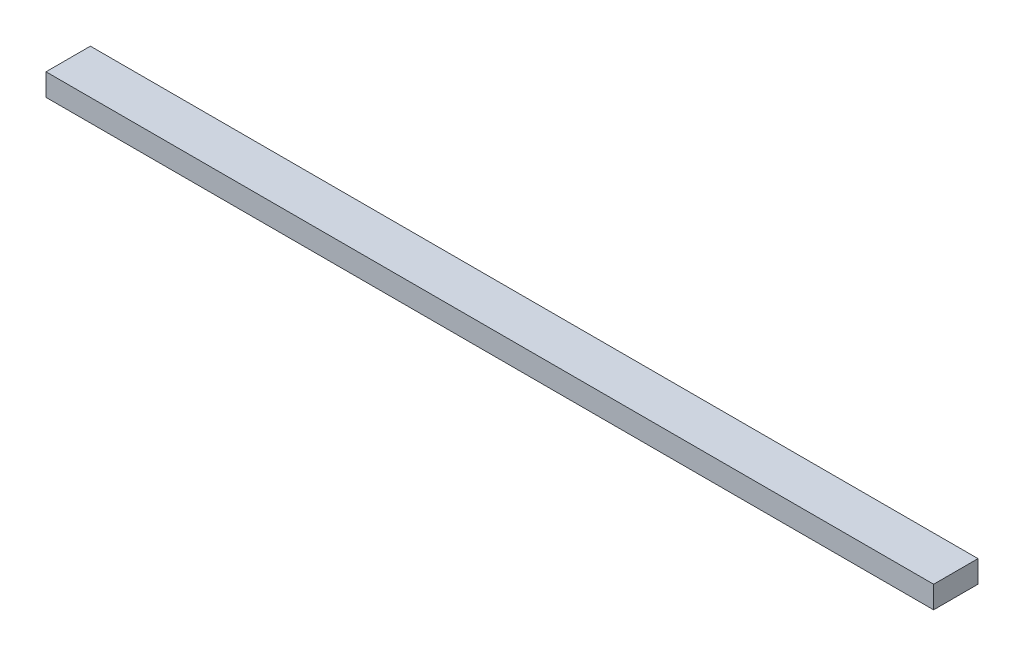
ISO-10303-21;
HEADER;
FILE_DESCRIPTION(('STEP AP214'),'2;1');
FILE_NAME('part.step','',(''),(''),'','','');
FILE_SCHEMA(('AUTOMOTIVE_DESIGN { 1 0 10303 214 1 1 1 1 }'));
ENDSEC;
DATA;
#1=APPLICATION_CONTEXT('core data for automotive mechanical design processes');
#2=APPLICATION_PROTOCOL_DEFINITION('international standard','automotive_design',2000,#1);
#3=PRODUCT_CONTEXT('',#1,'mechanical');
#4=PRODUCT('Part','Part','',(#3));
#5=PRODUCT_RELATED_PRODUCT_CATEGORY('part','',(#4));
#6=PRODUCT_DEFINITION_FORMATION('','',#4);
#7=PRODUCT_DEFINITION_CONTEXT('part definition',#1,'design');
#8=PRODUCT_DEFINITION('design','',#6,#7);
#9=PRODUCT_DEFINITION_SHAPE('','',#8);
#10=(LENGTH_UNIT() NAMED_UNIT(*) SI_UNIT(.MILLI.,.METRE.));
#11=(NAMED_UNIT(*) PLANE_ANGLE_UNIT() SI_UNIT($,.RADIAN.));
#12=(NAMED_UNIT(*) SI_UNIT($,.STERADIAN.) SOLID_ANGLE_UNIT());
#13=UNCERTAINTY_MEASURE_WITH_UNIT(LENGTH_MEASURE(1.E-05),#10,'distance_accuracy_value','');
#14=(GEOMETRIC_REPRESENTATION_CONTEXT(3) GLOBAL_UNCERTAINTY_ASSIGNED_CONTEXT((#13)) GLOBAL_UNIT_ASSIGNED_CONTEXT((#10,
#11,#12)) REPRESENTATION_CONTEXT('',''));
#15=CARTESIAN_POINT('',(0.,0.,0.));
#16=DIRECTION('',(0.,0.,1.));
#17=DIRECTION('',(1.,0.,0.));
#18=AXIS2_PLACEMENT_3D('',#15,#16,#17);
#19=CARTESIAN_POINT('',(-200.,10.,-9.99999999999999));
#20=DIRECTION('',(1.,0.,0.));
#21=DIRECTION('',(0.,0.,-1.));
#22=AXIS2_PLACEMENT_3D('',#19,#20,#21);
#23=PLANE('',#22);
#24=DIRECTION('',(0.,0.,1.));
#25=VECTOR('',#24,1.);
#26=CARTESIAN_POINT('',(-200.,0.,-9.99999999999999));
#27=LINE('',#26,#25);
#28=CARTESIAN_POINT('',(-200.,0.,-9.99999999999999));
#29=VERTEX_POINT('',#28);
#30=CARTESIAN_POINT('',(-200.,0.,9.99999999999999));
#31=VERTEX_POINT('',#30);
#32=EDGE_CURVE('E95',#29,#31,#27,.T.);
#33=ORIENTED_EDGE('',*,*,#32,.T.);
#34=DIRECTION('',(0.,-1.,0.));
#35=VECTOR('',#34,1.);
#36=CARTESIAN_POINT('',(-200.,10.,9.99999999999999));
#37=LINE('',#36,#35);
#38=CARTESIAN_POINT('',(-200.,10.,9.99999999999999));
#39=VERTEX_POINT('',#38);
#40=EDGE_CURVE('E11',#39,#31,#37,.T.);
#41=ORIENTED_EDGE('',*,*,#40,.F.);
#42=DIRECTION('',(0.,0.,1.));
#43=VECTOR('',#42,1.);
#44=CARTESIAN_POINT('',(-200.,10.,-9.99999999999999));
#45=LINE('',#44,#43);
#46=CARTESIAN_POINT('',(-200.,10.,-9.99999999999999));
#47=VERTEX_POINT('',#46);
#48=EDGE_CURVE('E83',#47,#39,#45,.T.);
#49=ORIENTED_EDGE('',*,*,#48,.F.);
#50=DIRECTION('',(0.,-1.,0.));
#51=VECTOR('',#50,1.);
#52=CARTESIAN_POINT('',(-200.,10.,-9.99999999999999));
#53=LINE('',#52,#51);
#54=EDGE_CURVE('E91',#47,#29,#53,.T.);
#55=ORIENTED_EDGE('',*,*,#54,.T.);
#56=EDGE_LOOP('',(#33,#41,#49,#55));
#57=FACE_BOUND('',#56,.T.);
#58=ADVANCED_FACE('F32',(#57),#23,.F.);
#59=CARTESIAN_POINT('',(-200.,10.,9.99999999999999));
#60=DIRECTION('',(0.,0.,-1.));
#61=DIRECTION('',(-1.,0.,0.));
#62=AXIS2_PLACEMENT_3D('',#59,#60,#61);
#63=PLANE('',#62);
#64=DIRECTION('',(1.,0.,0.));
#65=VECTOR('',#64,1.);
#66=CARTESIAN_POINT('',(-200.,0.,9.99999999999999));
#67=LINE('',#66,#65);
#68=CARTESIAN_POINT('',(200.,0.,9.99999999999999));
#69=VERTEX_POINT('',#68);
#70=EDGE_CURVE('E87',#31,#69,#67,.T.);
#71=ORIENTED_EDGE('',*,*,#70,.T.);
#72=DIRECTION('',(0.,-1.,0.));
#73=VECTOR('',#72,1.);
#74=CARTESIAN_POINT('',(200.,10.,9.99999999999999));
#75=LINE('',#74,#73);
#76=CARTESIAN_POINT('',(200.,10.,9.99999999999999));
#77=VERTEX_POINT('',#76);
#78=EDGE_CURVE('E40',#77,#69,#75,.T.);
#79=ORIENTED_EDGE('',*,*,#78,.F.);
#80=DIRECTION('',(1.,0.,0.));
#81=VECTOR('',#80,1.);
#82=CARTESIAN_POINT('',(-200.,10.,9.99999999999999));
#83=LINE('',#82,#81);
#84=EDGE_CURVE('E78',#39,#77,#83,.T.);
#85=ORIENTED_EDGE('',*,*,#84,.F.);
#86=ORIENTED_EDGE('',*,*,#40,.T.);
#87=EDGE_LOOP('',(#71,#79,#85,#86));
#88=FACE_BOUND('',#87,.T.);
#89=ADVANCED_FACE('F86',(#88),#63,.F.);
#90=CARTESIAN_POINT('',(200.,10.,-9.99999999999999));
#91=DIRECTION('',(-1.,0.,0.));
#92=DIRECTION('',(0.,0.,1.));
#93=AXIS2_PLACEMENT_3D('',#90,#91,#92);
#94=PLANE('',#93);
#95=DIRECTION('',(0.,0.,-1.));
#96=VECTOR('',#95,1.);
#97=CARTESIAN_POINT('',(200.,0.,-9.99999999999999));
#98=LINE('',#97,#96);
#99=CARTESIAN_POINT('',(200.,0.,-9.99999999999999));
#100=VERTEX_POINT('',#99);
#101=EDGE_CURVE('E65',#69,#100,#98,.T.);
#102=ORIENTED_EDGE('',*,*,#101,.T.);
#103=DIRECTION('',(0.,-1.,0.));
#104=VECTOR('',#103,1.);
#105=CARTESIAN_POINT('',(200.,10.,-9.99999999999999));
#106=LINE('',#105,#104);
#107=CARTESIAN_POINT('',(200.,10.,-9.99999999999999));
#108=VERTEX_POINT('',#107);
#109=EDGE_CURVE('E88',#108,#100,#106,.T.);
#110=ORIENTED_EDGE('',*,*,#109,.F.);
#111=DIRECTION('',(0.,0.,-1.));
#112=VECTOR('',#111,1.);
#113=CARTESIAN_POINT('',(200.,10.,-9.99999999999999));
#114=LINE('',#113,#112);
#115=EDGE_CURVE('E81',#77,#108,#114,.T.);
#116=ORIENTED_EDGE('',*,*,#115,.F.);
#117=ORIENTED_EDGE('',*,*,#78,.T.);
#118=EDGE_LOOP('',(#102,#110,#116,#117));
#119=FACE_BOUND('',#118,.T.);
#120=ADVANCED_FACE('F89',(#119),#94,.F.);
#121=CARTESIAN_POINT('',(-200.,10.,-9.99999999999999));
#122=DIRECTION('',(0.,0.,1.));
#123=DIRECTION('',(1.,0.,0.));
#124=AXIS2_PLACEMENT_3D('',#121,#122,#123);
#125=PLANE('',#124);
#126=DIRECTION('',(-1.,0.,0.));
#127=VECTOR('',#126,1.);
#128=CARTESIAN_POINT('',(-200.,0.,-9.99999999999999));
#129=LINE('',#128,#127);
#130=EDGE_CURVE('E71',#100,#29,#129,.T.);
#131=ORIENTED_EDGE('',*,*,#130,.T.);
#132=ORIENTED_EDGE('',*,*,#54,.F.);
#133=DIRECTION('',(-1.,0.,0.));
#134=VECTOR('',#133,1.);
#135=CARTESIAN_POINT('',(-200.,10.,-9.99999999999999));
#136=LINE('',#135,#134);
#137=EDGE_CURVE('E48',#108,#47,#136,.T.);
#138=ORIENTED_EDGE('',*,*,#137,.F.);
#139=ORIENTED_EDGE('',*,*,#109,.T.);
#140=EDGE_LOOP('',(#131,#132,#138,#139));
#141=FACE_BOUND('',#140,.T.);
#142=ADVANCED_FACE('F102',(#141),#125,.F.);
#143=CARTESIAN_POINT('',(0.,10.,0.));
#144=DIRECTION('',(0.,1.,0.));
#145=DIRECTION('',(0.,0.,1.));
#146=AXIS2_PLACEMENT_3D('',#143,#144,#145);
#147=PLANE('',#146);
#148=ORIENTED_EDGE('',*,*,#48,.T.);
#149=ORIENTED_EDGE('',*,*,#84,.T.);
#150=ORIENTED_EDGE('',*,*,#115,.T.);
#151=ORIENTED_EDGE('',*,*,#137,.T.);
#152=EDGE_LOOP('',(#148,#149,#150,#151));
#153=FACE_BOUND('',#152,.T.);
#154=ADVANCED_FACE('F79',(#153),#147,.T.);
#155=CARTESIAN_POINT('',(0.,0.,0.));
#156=DIRECTION('',(0.,1.,0.));
#157=DIRECTION('',(0.,0.,1.));
#158=AXIS2_PLACEMENT_3D('',#155,#156,#157);
#159=PLANE('',#158);
#160=ORIENTED_EDGE('',*,*,#32,.F.);
#161=ORIENTED_EDGE('',*,*,#130,.F.);
#162=ORIENTED_EDGE('',*,*,#101,.F.);
#163=ORIENTED_EDGE('',*,*,#70,.F.);
#164=EDGE_LOOP('',(#160,#161,#162,#163));
#165=FACE_BOUND('',#164,.T.);
#166=ADVANCED_FACE('F105',(#165),#159,.F.);
#167=CLOSED_SHELL('',(#58,#89,#120,#142,#154,#166));
#168=MANIFOLD_SOLID_BREP('B2',#167);
#169=ADVANCED_BREP_SHAPE_REPRESENTATION('',(#18,#168),#14);
#170=SHAPE_DEFINITION_REPRESENTATION(#9,#169);
ENDSEC;
END-ISO-10303-21;
